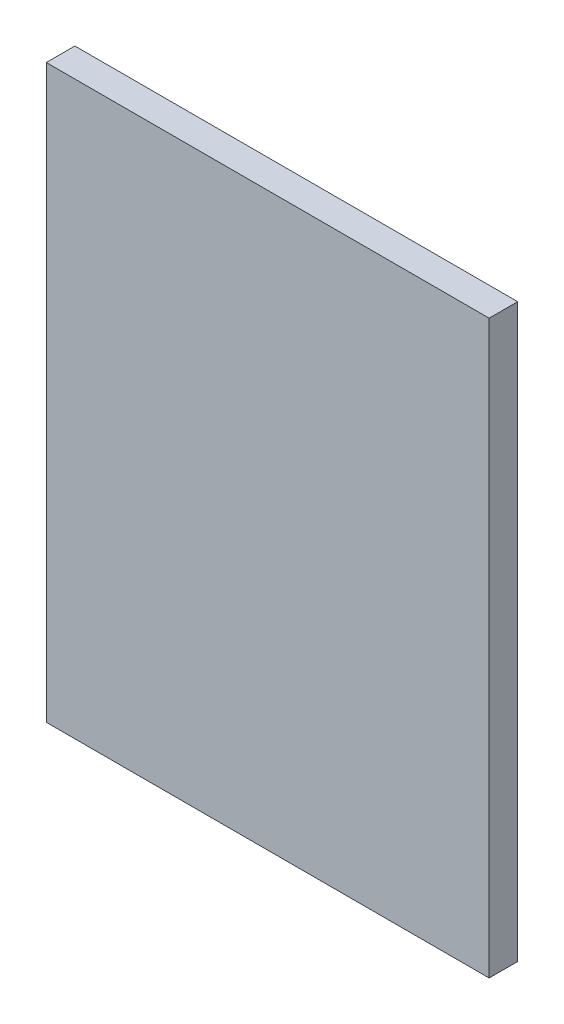
ISO-10303-21;
HEADER;
FILE_DESCRIPTION(('STEP AP214'),'2;1');
FILE_NAME('part.step','',(''),(''),'','','');
FILE_SCHEMA(('AUTOMOTIVE_DESIGN { 1 0 10303 214 1 1 1 1 }'));
ENDSEC;
DATA;
#1=APPLICATION_CONTEXT('core data for automotive mechanical design processes');
#2=APPLICATION_PROTOCOL_DEFINITION('international standard','automotive_design',2000,#1);
#3=PRODUCT_CONTEXT('',#1,'mechanical');
#4=PRODUCT('Part','Part','',(#3));
#5=PRODUCT_RELATED_PRODUCT_CATEGORY('part','',(#4));
#6=PRODUCT_DEFINITION_FORMATION('','',#4);
#7=PRODUCT_DEFINITION_CONTEXT('part definition',#1,'design');
#8=PRODUCT_DEFINITION('design','',#6,#7);
#9=PRODUCT_DEFINITION_SHAPE('','',#8);
#10=(LENGTH_UNIT() NAMED_UNIT(*) SI_UNIT(.MILLI.,.METRE.));
#11=(NAMED_UNIT(*) PLANE_ANGLE_UNIT() SI_UNIT($,.RADIAN.));
#12=(NAMED_UNIT(*) SI_UNIT($,.STERADIAN.) SOLID_ANGLE_UNIT());
#13=UNCERTAINTY_MEASURE_WITH_UNIT(LENGTH_MEASURE(1.E-05),#10,'distance_accuracy_value','');
#14=(GEOMETRIC_REPRESENTATION_CONTEXT(3) GLOBAL_UNCERTAINTY_ASSIGNED_CONTEXT((#13)) GLOBAL_UNIT_ASSIGNED_CONTEXT((#10,
#11,#12)) REPRESENTATION_CONTEXT('',''));
#15=CARTESIAN_POINT('',(0.,0.,0.));
#16=DIRECTION('',(0.,0.,1.));
#17=DIRECTION('',(1.,0.,0.));
#18=AXIS2_PLACEMENT_3D('',#15,#16,#17);
#19=CARTESIAN_POINT('',(0.,0.,10.));
#20=DIRECTION('',(1.,0.,0.));
#21=DIRECTION('',(0.,0.,-1.));
#22=AXIS2_PLACEMENT_3D('',#19,#20,#21);
#23=PLANE('',#22);
#24=DIRECTION('',(0.,-1.,0.));
#25=VECTOR('',#24,1.);
#26=CARTESIAN_POINT('',(0.,0.,0.));
#27=LINE('',#26,#25);
#28=CARTESIAN_POINT('',(0.,200.,0.));
#29=VERTEX_POINT('',#28);
#30=CARTESIAN_POINT('',(0.,0.,0.));
#31=VERTEX_POINT('',#30);
#32=EDGE_CURVE('E97',#29,#31,#27,.T.);
#33=ORIENTED_EDGE('',*,*,#32,.T.);
#34=DIRECTION('',(0.,0.,-1.));
#35=VECTOR('',#34,1.);
#36=CARTESIAN_POINT('',(0.,0.,10.));
#37=LINE('',#36,#35);
#38=CARTESIAN_POINT('',(0.,0.,10.));
#39=VERTEX_POINT('',#38);
#40=EDGE_CURVE('E11',#39,#31,#37,.T.);
#41=ORIENTED_EDGE('',*,*,#40,.F.);
#42=DIRECTION('',(0.,-1.,0.));
#43=VECTOR('',#42,1.);
#44=CARTESIAN_POINT('',(0.,0.,10.));
#45=LINE('',#44,#43);
#46=CARTESIAN_POINT('',(0.,200.,10.));
#47=VERTEX_POINT('',#46);
#48=EDGE_CURVE('E85',#47,#39,#45,.T.);
#49=ORIENTED_EDGE('',*,*,#48,.F.);
#50=DIRECTION('',(0.,0.,-1.));
#51=VECTOR('',#50,1.);
#52=CARTESIAN_POINT('',(0.,200.,10.));
#53=LINE('',#52,#51);
#54=EDGE_CURVE('E93',#47,#29,#53,.T.);
#55=ORIENTED_EDGE('',*,*,#54,.T.);
#56=EDGE_LOOP('',(#33,#41,#49,#55));
#57=FACE_BOUND('',#56,.T.);
#58=ADVANCED_FACE('F34',(#57),#23,.F.);
#59=CARTESIAN_POINT('',(0.,0.,10.));
#60=DIRECTION('',(0.,1.,0.));
#61=DIRECTION('',(0.,0.,1.));
#62=AXIS2_PLACEMENT_3D('',#59,#60,#61);
#63=PLANE('',#62);
#64=DIRECTION('',(1.,0.,0.));
#65=VECTOR('',#64,1.);
#66=CARTESIAN_POINT('',(0.,0.,0.));
#67=LINE('',#66,#65);
#68=CARTESIAN_POINT('',(155.,0.,0.));
#69=VERTEX_POINT('',#68);
#70=EDGE_CURVE('E89',#31,#69,#67,.T.);
#71=ORIENTED_EDGE('',*,*,#70,.T.);
#72=DIRECTION('',(0.,0.,-1.));
#73=VECTOR('',#72,1.);
#74=CARTESIAN_POINT('',(155.,0.,10.));
#75=LINE('',#74,#73);
#76=CARTESIAN_POINT('',(155.,0.,10.));
#77=VERTEX_POINT('',#76);
#78=EDGE_CURVE('E42',#77,#69,#75,.T.);
#79=ORIENTED_EDGE('',*,*,#78,.F.);
#80=DIRECTION('',(1.,0.,0.));
#81=VECTOR('',#80,1.);
#82=CARTESIAN_POINT('',(0.,0.,10.));
#83=LINE('',#82,#81);
#84=EDGE_CURVE('E80',#39,#77,#83,.T.);
#85=ORIENTED_EDGE('',*,*,#84,.F.);
#86=ORIENTED_EDGE('',*,*,#40,.T.);
#87=EDGE_LOOP('',(#71,#79,#85,#86));
#88=FACE_BOUND('',#87,.T.);
#89=ADVANCED_FACE('F88',(#88),#63,.F.);
#90=CARTESIAN_POINT('',(155.,0.,10.));
#91=DIRECTION('',(-1.,0.,0.));
#92=DIRECTION('',(0.,0.,1.));
#93=AXIS2_PLACEMENT_3D('',#90,#91,#92);
#94=PLANE('',#93);
#95=DIRECTION('',(0.,1.,0.));
#96=VECTOR('',#95,1.);
#97=CARTESIAN_POINT('',(155.,0.,0.));
#98=LINE('',#97,#96);
#99=CARTESIAN_POINT('',(155.,200.,0.));
#100=VERTEX_POINT('',#99);
#101=EDGE_CURVE('E67',#69,#100,#98,.T.);
#102=ORIENTED_EDGE('',*,*,#101,.T.);
#103=DIRECTION('',(0.,0.,-1.));
#104=VECTOR('',#103,1.);
#105=CARTESIAN_POINT('',(155.,200.,10.));
#106=LINE('',#105,#104);
#107=CARTESIAN_POINT('',(155.,200.,10.));
#108=VERTEX_POINT('',#107);
#109=EDGE_CURVE('E90',#108,#100,#106,.T.);
#110=ORIENTED_EDGE('',*,*,#109,.F.);
#111=DIRECTION('',(0.,1.,0.));
#112=VECTOR('',#111,1.);
#113=CARTESIAN_POINT('',(155.,0.,10.));
#114=LINE('',#113,#112);
#115=EDGE_CURVE('E83',#77,#108,#114,.T.);
#116=ORIENTED_EDGE('',*,*,#115,.F.);
#117=ORIENTED_EDGE('',*,*,#78,.T.);
#118=EDGE_LOOP('',(#102,#110,#116,#117));
#119=FACE_BOUND('',#118,.T.);
#120=ADVANCED_FACE('F91',(#119),#94,.F.);
#121=CARTESIAN_POINT('',(0.,200.,10.));
#122=DIRECTION('',(0.,-1.,0.));
#123=DIRECTION('',(0.,0.,-1.));
#124=AXIS2_PLACEMENT_3D('',#121,#122,#123);
#125=PLANE('',#124);
#126=DIRECTION('',(-1.,0.,0.));
#127=VECTOR('',#126,1.);
#128=CARTESIAN_POINT('',(0.,200.,0.));
#129=LINE('',#128,#127);
#130=EDGE_CURVE('E73',#100,#29,#129,.T.);
#131=ORIENTED_EDGE('',*,*,#130,.T.);
#132=ORIENTED_EDGE('',*,*,#54,.F.);
#133=DIRECTION('',(-1.,0.,0.));
#134=VECTOR('',#133,1.);
#135=CARTESIAN_POINT('',(0.,200.,10.));
#136=LINE('',#135,#134);
#137=EDGE_CURVE('E50',#108,#47,#136,.T.);
#138=ORIENTED_EDGE('',*,*,#137,.F.);
#139=ORIENTED_EDGE('',*,*,#109,.T.);
#140=EDGE_LOOP('',(#131,#132,#138,#139));
#141=FACE_BOUND('',#140,.T.);
#142=ADVANCED_FACE('F104',(#141),#125,.F.);
#143=CARTESIAN_POINT('',(0.,0.,10.));
#144=DIRECTION('',(0.,0.,-1.));
#145=DIRECTION('',(-1.,0.,0.));
#146=AXIS2_PLACEMENT_3D('',#143,#144,#145);
#147=PLANE('',#146);
#148=ORIENTED_EDGE('',*,*,#48,.T.);
#149=ORIENTED_EDGE('',*,*,#84,.T.);
#150=ORIENTED_EDGE('',*,*,#115,.T.);
#151=ORIENTED_EDGE('',*,*,#137,.T.);
#152=EDGE_LOOP('',(#148,#149,#150,#151));
#153=FACE_BOUND('',#152,.T.);
#154=ADVANCED_FACE('F81',(#153),#147,.F.);
#155=CARTESIAN_POINT('',(0.,0.,0.));
#156=DIRECTION('',(0.,0.,-1.));
#157=DIRECTION('',(-1.,0.,0.));
#158=AXIS2_PLACEMENT_3D('',#155,#156,#157);
#159=PLANE('',#158);
#160=ORIENTED_EDGE('',*,*,#32,.F.);
#161=ORIENTED_EDGE('',*,*,#130,.F.);
#162=ORIENTED_EDGE('',*,*,#101,.F.);
#163=ORIENTED_EDGE('',*,*,#70,.F.);
#164=EDGE_LOOP('',(#160,#161,#162,#163));
#165=FACE_BOUND('',#164,.T.);
#166=ADVANCED_FACE('F107',(#165),#159,.T.);
#167=CLOSED_SHELL('',(#58,#89,#120,#142,#154,#166));
#168=MANIFOLD_SOLID_BREP('B2',#167);
#169=ADVANCED_BREP_SHAPE_REPRESENTATION('',(#18,#168),#14);
#170=SHAPE_DEFINITION_REPRESENTATION(#9,#169);
ENDSEC;
END-ISO-10303-21;
